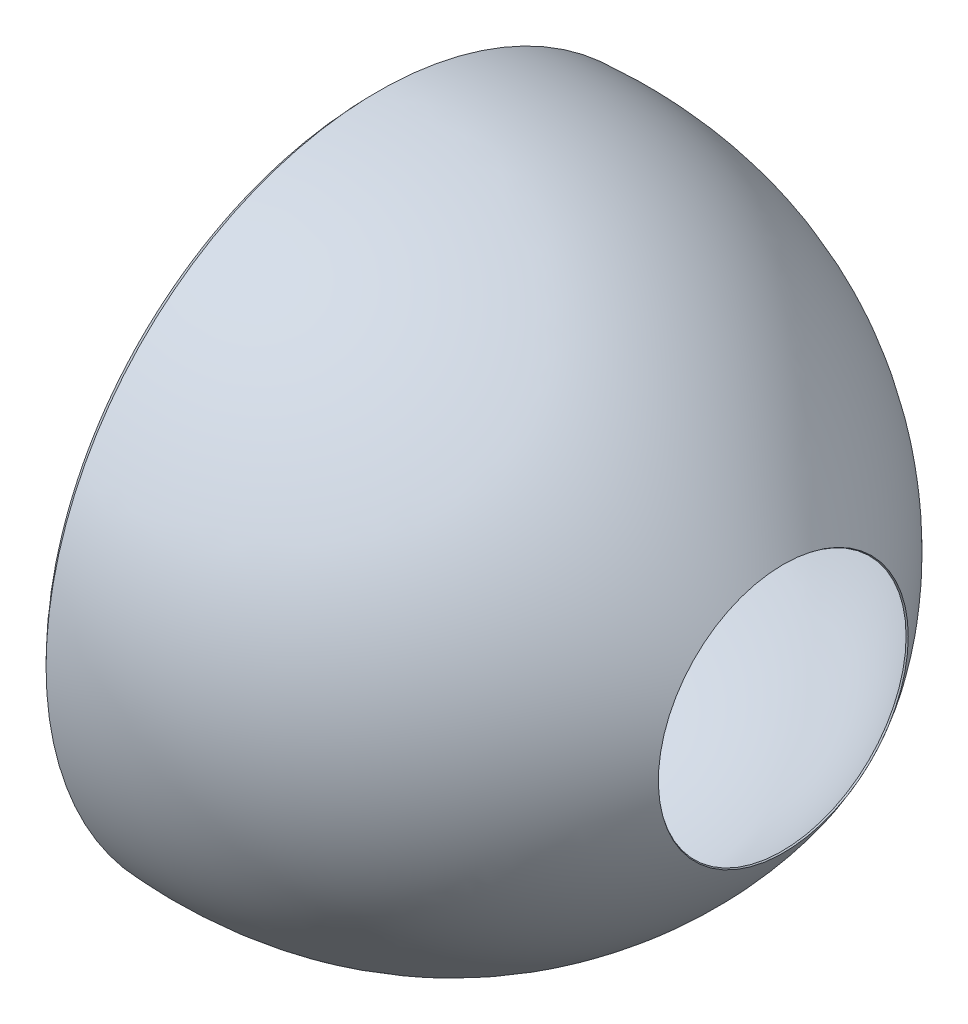
ISO-10303-21;
HEADER;
FILE_DESCRIPTION(('STEP AP214'),'2;1');
FILE_NAME('part.step','',(''),(''),'','','');
FILE_SCHEMA(('AUTOMOTIVE_DESIGN { 1 0 10303 214 1 1 1 1 }'));
ENDSEC;
DATA;
#1=APPLICATION_CONTEXT('core data for automotive mechanical design processes');
#2=APPLICATION_PROTOCOL_DEFINITION('international standard','automotive_design',2000,#1);
#3=PRODUCT_CONTEXT('',#1,'mechanical');
#4=PRODUCT('Part','Part','',(#3));
#5=PRODUCT_RELATED_PRODUCT_CATEGORY('part','',(#4));
#6=PRODUCT_DEFINITION_FORMATION('','',#4);
#7=PRODUCT_DEFINITION_CONTEXT('part definition',#1,'design');
#8=PRODUCT_DEFINITION('design','',#6,#7);
#9=PRODUCT_DEFINITION_SHAPE('','',#8);
#10=(LENGTH_UNIT() NAMED_UNIT(*) SI_UNIT(.MILLI.,.METRE.));
#11=(NAMED_UNIT(*) PLANE_ANGLE_UNIT() SI_UNIT($,.RADIAN.));
#12=(NAMED_UNIT(*) SI_UNIT($,.STERADIAN.) SOLID_ANGLE_UNIT());
#13=UNCERTAINTY_MEASURE_WITH_UNIT(LENGTH_MEASURE(1.E-05),#10,'distance_accuracy_value','');
#14=(GEOMETRIC_REPRESENTATION_CONTEXT(3) GLOBAL_UNCERTAINTY_ASSIGNED_CONTEXT((#13)) GLOBAL_UNIT_ASSIGNED_CONTEXT((#10,
#11,#12)) REPRESENTATION_CONTEXT('',''));
#15=CARTESIAN_POINT('',(0.,0.,0.));
#16=DIRECTION('',(0.,0.,1.));
#17=DIRECTION('',(1.,0.,0.));
#18=AXIS2_PLACEMENT_3D('',#15,#16,#17);
#19=CARTESIAN_POINT('',(58.1645223558109,0.,0.));
#20=DIRECTION('',(-1.,0.,0.));
#21=DIRECTION('',(0.,0.,1.));
#22=AXIS2_PLACEMENT_3D('',#19,#20,#21);
#23=PLANE('',#22);
#24=CARTESIAN_POINT('',(58.1645223558109,0.,0.));
#25=DIRECTION('',(1.,0.,0.));
#26=DIRECTION('',(0.,0.,-1.));
#27=AXIS2_PLACEMENT_3D('',#24,#25,#26);
#28=CIRCLE('',#27,915.);
#29=CARTESIAN_POINT('',(58.1645223558109,0.,-915.));
#30=VERTEX_POINT('',#29);
#31=EDGE_CURVE('E51',#30,#30,#28,.T.);
#32=ORIENTED_EDGE('',*,*,#31,.F.);
#33=EDGE_LOOP('',(#32));
#34=FACE_BOUND('',#33,.T.);
#35=CARTESIAN_POINT('',(58.1645223558109,0.,0.));
#36=DIRECTION('',(1.,0.,0.));
#37=DIRECTION('',(0.,0.,-1.));
#38=AXIS2_PLACEMENT_3D('',#35,#36,#37);
#39=CIRCLE('',#38,920.);
#40=CARTESIAN_POINT('',(58.1645223558109,0.,-920.));
#41=VERTEX_POINT('',#40);
#42=EDGE_CURVE('E114',#41,#41,#39,.T.);
#43=ORIENTED_EDGE('',*,*,#42,.T.);
#44=EDGE_LOOP('',(#43));
#45=FACE_BOUND('',#44,.T.);
#46=ADVANCED_FACE('F33',(#34,#45),#23,.F.);
#47=CARTESIAN_POINT('',(1300.,0.,0.));
#48=DIRECTION('',(1.,0.,0.));
#49=DIRECTION('',(0.,0.,-1.));
#50=AXIS2_PLACEMENT_3D('',#47,#48,#49);
#51=CONICAL_SURFACE('',#50,400.,0.607783046130736);
#52=CARTESIAN_POINT('',(1304.1045801165,0.,0.));
#53=DIRECTION('',(1.,0.,0.));
#54=DIRECTION('',(0.,1.,0.));
#55=AXIS2_PLACEMENT_3D('',#52,#53,#54);
#56=CIRCLE('',#55,402.855244659781);
#57=CARTESIAN_POINT('',(1304.1045801165,402.855244659781,0.));
#58=VERTEX_POINT('',#57);
#59=EDGE_CURVE('E10',#58,#58,#56,.T.);
#60=ORIENTED_EDGE('',*,*,#59,.T.);
#61=EDGE_LOOP('',(#60));
#62=FACE_BOUND('',#61,.T.);
#63=CARTESIAN_POINT('',(1300.,0.,0.));
#64=DIRECTION('',(1.,0.,0.));
#65=DIRECTION('',(0.,0.,-1.));
#66=AXIS2_PLACEMENT_3D('',#63,#64,#65);
#67=CIRCLE('',#66,400.);
#68=CARTESIAN_POINT('',(1300.,0.,-400.));
#69=VERTEX_POINT('',#68);
#70=EDGE_CURVE('E36',#69,#69,#67,.T.);
#71=ORIENTED_EDGE('',*,*,#70,.F.);
#72=EDGE_LOOP('',(#71));
#73=FACE_BOUND('',#72,.T.);
#74=ADVANCED_FACE('F150',(#62,#73),#51,.F.);
#75=CARTESIAN_POINT('',(1300.,400.,0.));
#76=CARTESIAN_POINT('',(802.443853743599,1115.26587319638,0.));
#77=CARTESIAN_POINT('',(-8.02443853743599,1065.4410438261,0.));
#78=CARTESIAN_POINT('',(-16.048877074872,1064.94772868382,0.));
#79=B_SPLINE_CURVE_WITH_KNOTS('',2,(#75,#76,#77,#78),.UNSPECIFIED.,.F.,.F.,(3,1,3),(0.,1.,1.01),.UNSPECIFIED.);
#80=CARTESIAN_POINT('',(0.,0.,0.));
#81=DIRECTION('',(1.,0.,0.));
#82=AXIS1_PLACEMENT('',#80,#81);
#83=SURFACE_OF_REVOLUTION('',#79,#82);
#84=OFFSET_SURFACE('',#83,-5.,.F.);
#85=CARTESIAN_POINT('',(-2.10633460824944,0.,0.));
#86=DIRECTION('',(1.,0.,0.));
#87=DIRECTION('',(0.,0.,-1.));
#88=AXIS2_PLACEMENT_3D('',#85,#86,#87);
#89=CIRCLE('',#88,1070.81430821115);
#90=CARTESIAN_POINT('',(-2.10633460824944,0.,-1070.81430821115));
#91=VERTEX_POINT('',#90);
#92=EDGE_CURVE('E40',#91,#91,#89,.T.);
#93=ORIENTED_EDGE('',*,*,#92,.T.);
#94=EDGE_LOOP('',(#93));
#95=FACE_BOUND('',#94,.T.);
#96=ORIENTED_EDGE('',*,*,#59,.F.);
#97=EDGE_LOOP('',(#96));
#98=FACE_BOUND('',#97,.T.);
#99=ADVANCED_FACE('F70',(#95,#98),#84,.F.);
#100=CARTESIAN_POINT('',(1.93328944860431,1067.74825647392,0.));
#101=CARTESIAN_POINT('',(0.966644724302153,1066.84130772115,0.));
#102=CARTESIAN_POINT('',(-96.6644724302153,975.239483691246,0.));
#103=CARTESIAN_POINT('',(0.966644724302153,899.247605163088,0.));
#104=CARTESIAN_POINT('',(1.93328944860431,898.495210326175,0.));
#105=B_SPLINE_CURVE_WITH_KNOTS('',2,(#100,#101,#102,#103,#104),.UNSPECIFIED.,.F.,.F.,(3,1,1,3),
(-0.01,0.,1.,1.01),.UNSPECIFIED.);
#106=CARTESIAN_POINT('',(0.,0.,0.));
#107=DIRECTION('',(1.,0.,0.));
#108=AXIS1_PLACEMENT('',#106,#107);
#109=SURFACE_OF_REVOLUTION('',#105,#108);
#110=OFFSET_SURFACE('',#109,-5.,.F.);
#111=CARTESIAN_POINT('',(-1.71654726428029,0.,0.));
#112=DIRECTION('',(1.,0.,0.));
#113=DIRECTION('',(0.,0.,-1.));
#114=AXIS2_PLACEMENT_3D('',#111,#112,#113);
#115=CIRCLE('',#114,895.);
#116=CARTESIAN_POINT('',(-1.71654726428029,0.,-895.));
#117=VERTEX_POINT('',#116);
#118=EDGE_CURVE('E45',#117,#117,#115,.T.);
#119=ORIENTED_EDGE('',*,*,#118,.T.);
#120=EDGE_LOOP('',(#119));
#121=FACE_BOUND('',#120,.T.);
#122=ORIENTED_EDGE('',*,*,#92,.F.);
#123=EDGE_LOOP('',(#122));
#124=FACE_BOUND('',#123,.T.);
#125=ADVANCED_FACE('F71',(#121,#124),#110,.F.);
#126=CARTESIAN_POINT('',(0.,0.,0.));
#127=DIRECTION('',(1.,0.,0.));
#128=DIRECTION('',(0.,0.,-1.));
#129=AXIS2_PLACEMENT_3D('',#126,#127,#128);
#130=CYLINDRICAL_SURFACE('',#129,895.);
#131=CARTESIAN_POINT('',(28.3594447582819,0.,0.));
#132=DIRECTION('',(1.,0.,0.));
#133=DIRECTION('',(0.,0.,-1.));
#134=AXIS2_PLACEMENT_3D('',#131,#132,#133);
#135=CIRCLE('',#134,895.);
#136=CARTESIAN_POINT('',(28.3594447582819,0.,-895.));
#137=VERTEX_POINT('',#136);
#138=EDGE_CURVE('E54',#137,#137,#135,.T.);
#139=ORIENTED_EDGE('',*,*,#138,.T.);
#140=EDGE_LOOP('',(#139));
#141=FACE_BOUND('',#140,.T.);
#142=ORIENTED_EDGE('',*,*,#118,.F.);
#143=EDGE_LOOP('',(#142));
#144=FACE_BOUND('',#143,.T.);
#145=ADVANCED_FACE('F74',(#141,#144),#130,.F.);
#146=CARTESIAN_POINT('',(29.6291364146602,0.,0.));
#147=DIRECTION('',(1.,0.,0.));
#148=DIRECTION('',(0.,0.,-1.));
#149=AXIS2_PLACEMENT_3D('',#146,#147,#148);
#150=CONICAL_SURFACE('',#149,898.11026561272,1.18321864543573);
#151=CARTESIAN_POINT('',(36.5239671140928,0.,0.));
#152=DIRECTION('',(1.,0.,0.));
#153=DIRECTION('',(0.,0.,-1.));
#154=AXIS2_PLACEMENT_3D('',#151,#152,#153);
#155=CIRCLE('',#154,915.);
#156=CARTESIAN_POINT('',(36.5239671140928,0.,-915.));
#157=VERTEX_POINT('',#156);
#158=EDGE_CURVE('E49',#157,#157,#155,.T.);
#159=ORIENTED_EDGE('',*,*,#158,.T.);
#160=EDGE_LOOP('',(#159));
#161=FACE_BOUND('',#160,.T.);
#162=ORIENTED_EDGE('',*,*,#138,.F.);
#163=EDGE_LOOP('',(#162));
#164=FACE_BOUND('',#163,.T.);
#165=ADVANCED_FACE('F80',(#161,#164),#150,.F.);
#166=CARTESIAN_POINT('',(0.,0.,0.));
#167=DIRECTION('',(1.,0.,0.));
#168=DIRECTION('',(0.,0.,-1.));
#169=AXIS2_PLACEMENT_3D('',#166,#167,#168);
#170=CYLINDRICAL_SURFACE('',#169,915.);
#171=ORIENTED_EDGE('',*,*,#31,.T.);
#172=EDGE_LOOP('',(#171));
#173=FACE_BOUND('',#172,.T.);
#174=ORIENTED_EDGE('',*,*,#158,.F.);
#175=EDGE_LOOP('',(#174));
#176=FACE_BOUND('',#175,.T.);
#177=ADVANCED_FACE('F84',(#173,#176),#170,.F.);
#178=CARTESIAN_POINT('',(1300.,400.,0.));
#179=CARTESIAN_POINT('',(802.443853743599,1115.26587319638,0.));
#180=CARTESIAN_POINT('',(0.,1065.93435896838,0.));
#181=B_SPLINE_CURVE_WITH_KNOTS('',2,(#178,#179,#180),.UNSPECIFIED.,.F.,.F.,(3,3),(0.,1.),.UNSPECIFIED.);
#182=CARTESIAN_POINT('',(0.,0.,0.));
#183=DIRECTION('',(1.,0.,0.));
#184=AXIS1_PLACEMENT('',#182,#183);
#185=SURFACE_OF_REVOLUTION('',#181,#184);
#186=CARTESIAN_POINT('',(0.,0.,0.));
#187=DIRECTION('',(1.,0.,0.));
#188=DIRECTION('',(0.,0.,-1.));
#189=AXIS2_PLACEMENT_3D('',#186,#187,#188);
#190=CIRCLE('',#189,1065.93435896838);
#191=CARTESIAN_POINT('',(0.,0.,-1065.93435896838));
#192=VERTEX_POINT('',#191);
#193=EDGE_CURVE('E128',#192,#192,#190,.T.);
#194=ORIENTED_EDGE('',*,*,#193,.F.);
#195=EDGE_LOOP('',(#194));
#196=FACE_BOUND('',#195,.T.);
#197=ORIENTED_EDGE('',*,*,#70,.T.);
#198=EDGE_LOOP('',(#197));
#199=FACE_BOUND('',#198,.T.);
#200=ADVANCED_FACE('F88',(#196,#199),#185,.T.);
#201=CARTESIAN_POINT('',(0.,1065.93435896838,0.));
#202=CARTESIAN_POINT('',(-96.6644724302153,975.239483691246,0.));
#203=CARTESIAN_POINT('',(0.,900.,0.));
#204=B_SPLINE_CURVE_WITH_KNOTS('',2,(#201,#202,#203),.UNSPECIFIED.,.F.,.F.,(3,3),(0.,1.),.UNSPECIFIED.);
#205=CARTESIAN_POINT('',(0.,0.,0.));
#206=DIRECTION('',(1.,0.,0.));
#207=AXIS1_PLACEMENT('',#205,#206);
#208=SURFACE_OF_REVOLUTION('',#204,#207);
#209=CARTESIAN_POINT('',(0.,0.,0.));
#210=DIRECTION('',(1.,0.,0.));
#211=DIRECTION('',(0.,0.,-1.));
#212=AXIS2_PLACEMENT_3D('',#209,#210,#211);
#213=CIRCLE('',#212,900.);
#214=CARTESIAN_POINT('',(0.,0.,-900.));
#215=VERTEX_POINT('',#214);
#216=EDGE_CURVE('E126',#215,#215,#213,.T.);
#217=ORIENTED_EDGE('',*,*,#216,.F.);
#218=EDGE_LOOP('',(#217));
#219=FACE_BOUND('',#218,.T.);
#220=ORIENTED_EDGE('',*,*,#193,.T.);
#221=EDGE_LOOP('',(#220));
#222=FACE_BOUND('',#221,.T.);
#223=ADVANCED_FACE('F101',(#219,#222),#208,.T.);
#224=CARTESIAN_POINT('',(0.,0.,0.));
#225=DIRECTION('',(1.,0.,0.));
#226=DIRECTION('',(0.,0.,-1.));
#227=AXIS2_PLACEMENT_3D('',#224,#225,#226);
#228=CYLINDRICAL_SURFACE('',#227,900.);
#229=CARTESIAN_POINT('',(25.,0.,0.));
#230=DIRECTION('',(1.,0.,0.));
#231=DIRECTION('',(0.,0.,-1.));
#232=AXIS2_PLACEMENT_3D('',#229,#230,#231);
#233=CIRCLE('',#232,900.);
#234=CARTESIAN_POINT('',(25.,0.,-900.));
#235=VERTEX_POINT('',#234);
#236=EDGE_CURVE('E120',#235,#235,#233,.T.);
#237=ORIENTED_EDGE('',*,*,#236,.F.);
#238=EDGE_LOOP('',(#237));
#239=FACE_BOUND('',#238,.T.);
#240=ORIENTED_EDGE('',*,*,#216,.T.);
#241=EDGE_LOOP('',(#240));
#242=FACE_BOUND('',#241,.T.);
#243=ADVANCED_FACE('F97',(#239,#242),#228,.T.);
#244=CARTESIAN_POINT('',(25.,0.,0.));
#245=DIRECTION('',(1.,0.,0.));
#246=DIRECTION('',(0.,0.,-1.));
#247=AXIS2_PLACEMENT_3D('',#244,#245,#246);
#248=CONICAL_SURFACE('',#247,900.,1.18321864543573);
#249=CARTESIAN_POINT('',(33.1645223558109,0.,0.));
#250=DIRECTION('',(1.,0.,0.));
#251=DIRECTION('',(0.,0.,-1.));
#252=AXIS2_PLACEMENT_3D('',#249,#250,#251);
#253=CIRCLE('',#252,920.);
#254=CARTESIAN_POINT('',(33.1645223558109,0.,-920.));
#255=VERTEX_POINT('',#254);
#256=EDGE_CURVE('E121',#255,#255,#253,.T.);
#257=ORIENTED_EDGE('',*,*,#256,.F.);
#258=EDGE_LOOP('',(#257));
#259=FACE_BOUND('',#258,.T.);
#260=ORIENTED_EDGE('',*,*,#236,.T.);
#261=EDGE_LOOP('',(#260));
#262=FACE_BOUND('',#261,.T.);
#263=ADVANCED_FACE('F93',(#259,#262),#248,.T.);
#264=CARTESIAN_POINT('',(0.,0.,0.));
#265=DIRECTION('',(1.,0.,0.));
#266=DIRECTION('',(0.,0.,-1.));
#267=AXIS2_PLACEMENT_3D('',#264,#265,#266);
#268=CYLINDRICAL_SURFACE('',#267,920.);
#269=ORIENTED_EDGE('',*,*,#42,.F.);
#270=EDGE_LOOP('',(#269));
#271=FACE_BOUND('',#270,.T.);
#272=ORIENTED_EDGE('',*,*,#256,.T.);
#273=EDGE_LOOP('',(#272));
#274=FACE_BOUND('',#273,.T.);
#275=ADVANCED_FACE('F90',(#271,#274),#268,.T.);
#276=CLOSED_SHELL('',(#46,#74,#99,#125,#145,#165,#177,#200,#223,#243,#263,#275));
#277=MANIFOLD_SOLID_BREP('B2',#276);
#278=ADVANCED_BREP_SHAPE_REPRESENTATION('',(#18,#277),#14);
#279=SHAPE_DEFINITION_REPRESENTATION(#9,#278);
ENDSEC;
END-ISO-10303-21;
